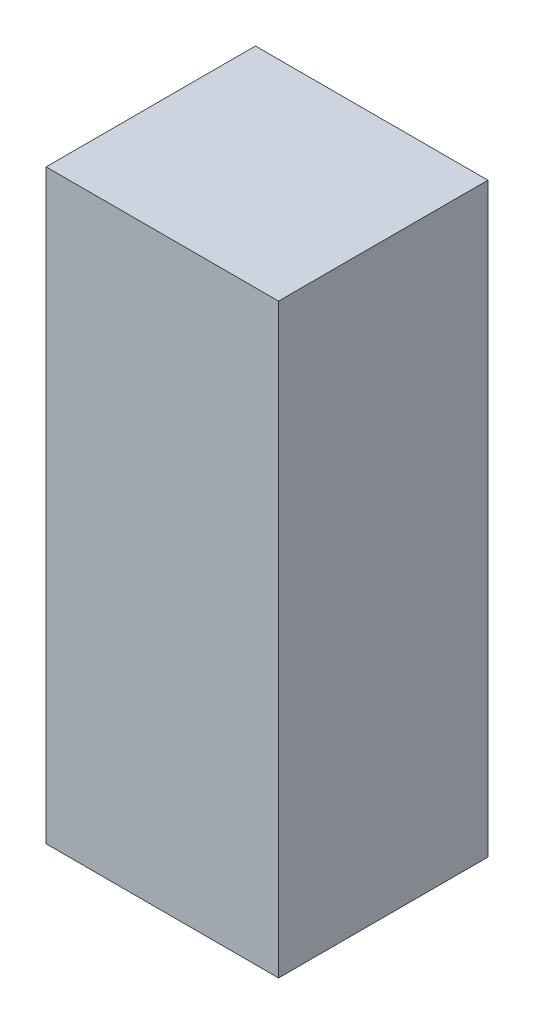
ISO-10303-21;
HEADER;
FILE_DESCRIPTION(('STEP AP214'),'2;1');
FILE_NAME('part.step','',(''),(''),'','','');
FILE_SCHEMA(('AUTOMOTIVE_DESIGN { 1 0 10303 214 1 1 1 1 }'));
ENDSEC;
DATA;
#1=APPLICATION_CONTEXT('core data for automotive mechanical design processes');
#2=APPLICATION_PROTOCOL_DEFINITION('international standard','automotive_design',2000,#1);
#3=PRODUCT_CONTEXT('',#1,'mechanical');
#4=PRODUCT('Part','Part','',(#3));
#5=PRODUCT_RELATED_PRODUCT_CATEGORY('part','',(#4));
#6=PRODUCT_DEFINITION_FORMATION('','',#4);
#7=PRODUCT_DEFINITION_CONTEXT('part definition',#1,'design');
#8=PRODUCT_DEFINITION('design','',#6,#7);
#9=PRODUCT_DEFINITION_SHAPE('','',#8);
#10=(LENGTH_UNIT() NAMED_UNIT(*) SI_UNIT(.MILLI.,.METRE.));
#11=(NAMED_UNIT(*) PLANE_ANGLE_UNIT() SI_UNIT($,.RADIAN.));
#12=(NAMED_UNIT(*) SI_UNIT($,.STERADIAN.) SOLID_ANGLE_UNIT());
#13=UNCERTAINTY_MEASURE_WITH_UNIT(LENGTH_MEASURE(1.E-05),#10,'distance_accuracy_value','');
#14=(GEOMETRIC_REPRESENTATION_CONTEXT(3) GLOBAL_UNCERTAINTY_ASSIGNED_CONTEXT((#13)) GLOBAL_UNIT_ASSIGNED_CONTEXT((#10,
#11,#12)) REPRESENTATION_CONTEXT('',''));
#15=CARTESIAN_POINT('',(0.,0.,0.));
#16=DIRECTION('',(0.,0.,1.));
#17=DIRECTION('',(1.,0.,0.));
#18=AXIS2_PLACEMENT_3D('',#15,#16,#17);
#19=CARTESIAN_POINT('',(-0.265118087285984,-10.0099997764826,1.5));
#20=DIRECTION('',(0.,0.,1.));
#21=DIRECTION('',(1.,0.,0.));
#22=AXIS2_PLACEMENT_3D('',#19,#20,#21);
#23=PLANE('',#22);
#24=DIRECTION('',(1.,0.,0.));
#25=VECTOR('',#24,1.);
#26=CARTESIAN_POINT('',(0.0224409530042465,-8.59999980777502,1.5));
#27=LINE('',#26,#25);
#28=CARTESIAN_POINT('',(-0.255118087285984,-8.59999980777502,1.5));
#29=VERTEX_POINT('',#28);
#30=CARTESIAN_POINT('',(0.299999993294477,-8.59999980777502,1.5));
#31=VERTEX_POINT('',#30);
#32=EDGE_CURVE('E70',#29,#31,#27,.T.);
#33=ORIENTED_EDGE('',*,*,#32,.F.);
#34=DIRECTION('',(0.,1.,0.));
#35=VECTOR('',#34,1.);
#36=CARTESIAN_POINT('',(-0.255118087285984,-9.29999979212881,1.5));
#37=LINE('',#36,#35);
#38=CARTESIAN_POINT('',(-0.255118087285984,-9.99999977648258,1.5));
#39=VERTEX_POINT('',#38);
#40=EDGE_CURVE('E56',#39,#29,#37,.T.);
#41=ORIENTED_EDGE('',*,*,#40,.F.);
#42=DIRECTION('',(-1.,0.,0.));
#43=VECTOR('',#42,1.);
#44=CARTESIAN_POINT('',(0.0224409530042464,-9.99999977648258,1.5));
#45=LINE('',#44,#43);
#46=CARTESIAN_POINT('',(0.299999993294477,-9.99999977648258,1.5));
#47=VERTEX_POINT('',#46);
#48=EDGE_CURVE('E20',#47,#39,#45,.T.);
#49=ORIENTED_EDGE('',*,*,#48,.F.);
#50=DIRECTION('',(0.,-1.,0.));
#51=VECTOR('',#50,1.);
#52=CARTESIAN_POINT('',(0.299999993294477,-9.29999979212881,1.5));
#53=LINE('',#52,#51);
#54=EDGE_CURVE('E88',#31,#47,#53,.T.);
#55=ORIENTED_EDGE('',*,*,#54,.F.);
#56=EDGE_LOOP('',(#33,#41,#49,#55));
#57=FACE_BOUND('',#56,.T.);
#58=ADVANCED_FACE('F16',(#57),#23,.T.);
#59=CARTESIAN_POINT('',(-0.265118087285984,-9.99999977648258,1.51));
#60=DIRECTION('',(0.,-1.,0.));
#61=DIRECTION('',(0.,0.,-1.));
#62=AXIS2_PLACEMENT_3D('',#59,#60,#61);
#63=PLANE('',#62);
#64=ORIENTED_EDGE('',*,*,#48,.T.);
#65=DIRECTION('',(0.,0.,1.));
#66=VECTOR('',#65,1.);
#67=CARTESIAN_POINT('',(-0.255118087285984,-9.99999977648258,1.25));
#68=LINE('',#67,#66);
#69=CARTESIAN_POINT('',(-0.255118087285984,-9.99999977648258,1.));
#70=VERTEX_POINT('',#69);
#71=EDGE_CURVE('E62',#70,#39,#68,.T.);
#72=ORIENTED_EDGE('',*,*,#71,.F.);
#73=DIRECTION('',(-1.,0.,0.));
#74=VECTOR('',#73,1.);
#75=CARTESIAN_POINT('',(0.0224409530042465,-9.99999977648258,1.));
#76=LINE('',#75,#74);
#77=CARTESIAN_POINT('',(0.299999993294477,-9.99999977648258,1.));
#78=VERTEX_POINT('',#77);
#79=EDGE_CURVE('E93',#78,#70,#76,.T.);
#80=ORIENTED_EDGE('',*,*,#79,.F.);
#81=DIRECTION('',(0.,0.,-1.));
#82=VECTOR('',#81,1.);
#83=CARTESIAN_POINT('',(0.299999993294477,-9.99999977648258,1.25));
#84=LINE('',#83,#82);
#85=EDGE_CURVE('E65',#47,#78,#84,.T.);
#86=ORIENTED_EDGE('',*,*,#85,.F.);
#87=EDGE_LOOP('',(#64,#72,#80,#86));
#88=FACE_BOUND('',#87,.T.);
#89=ADVANCED_FACE('F61',(#88),#63,.T.);
#90=CARTESIAN_POINT('',(-0.255118087285984,-8.58999980777502,0.99));
#91=DIRECTION('',(-1.,0.,0.));
#92=DIRECTION('',(0.,-1.,0.));
#93=AXIS2_PLACEMENT_3D('',#90,#91,#92);
#94=PLANE('',#93);
#95=ORIENTED_EDGE('',*,*,#40,.T.);
#96=DIRECTION('',(0.,0.,1.));
#97=VECTOR('',#96,1.);
#98=CARTESIAN_POINT('',(-0.255118087285984,-8.59999980777502,1.25));
#99=LINE('',#98,#97);
#100=CARTESIAN_POINT('',(-0.255118087285984,-8.59999980777502,1.));
#101=VERTEX_POINT('',#100);
#102=EDGE_CURVE('E73',#101,#29,#99,.T.);
#103=ORIENTED_EDGE('',*,*,#102,.F.);
#104=DIRECTION('',(0.,1.,0.));
#105=VECTOR('',#104,1.);
#106=CARTESIAN_POINT('',(-0.255118087285984,-9.29999979212881,1.));
#107=LINE('',#106,#105);
#108=EDGE_CURVE('E77',#70,#101,#107,.T.);
#109=ORIENTED_EDGE('',*,*,#108,.F.);
#110=ORIENTED_EDGE('',*,*,#71,.T.);
#111=EDGE_LOOP('',(#95,#103,#109,#110));
#112=FACE_BOUND('',#111,.T.);
#113=ADVANCED_FACE('F75',(#112),#94,.T.);
#114=CARTESIAN_POINT('',(0.309999993294477,-8.59999980777502,0.99));
#115=DIRECTION('',(0.,1.,0.));
#116=DIRECTION('',(-1.,0.,0.));
#117=AXIS2_PLACEMENT_3D('',#114,#115,#116);
#118=PLANE('',#117);
#119=ORIENTED_EDGE('',*,*,#32,.T.);
#120=DIRECTION('',(0.,0.,1.));
#121=VECTOR('',#120,1.);
#122=CARTESIAN_POINT('',(0.299999993294477,-8.59999980777502,1.25));
#123=LINE('',#122,#121);
#124=CARTESIAN_POINT('',(0.299999993294477,-8.59999980777502,1.));
#125=VERTEX_POINT('',#124);
#126=EDGE_CURVE('E36',#125,#31,#123,.T.);
#127=ORIENTED_EDGE('',*,*,#126,.F.);
#128=DIRECTION('',(1.,0.,0.));
#129=VECTOR('',#128,1.);
#130=CARTESIAN_POINT('',(0.0224409530042465,-8.59999980777502,1.));
#131=LINE('',#130,#129);
#132=EDGE_CURVE('E27',#101,#125,#131,.T.);
#133=ORIENTED_EDGE('',*,*,#132,.F.);
#134=ORIENTED_EDGE('',*,*,#102,.T.);
#135=EDGE_LOOP('',(#119,#127,#133,#134));
#136=FACE_BOUND('',#135,.T.);
#137=ADVANCED_FACE('F101',(#136),#118,.T.);
#138=CARTESIAN_POINT('',(0.299999993294477,-10.0099997764826,0.99));
#139=DIRECTION('',(1.,0.,0.));
#140=DIRECTION('',(0.,1.,0.));
#141=AXIS2_PLACEMENT_3D('',#138,#139,#140);
#142=PLANE('',#141);
#143=ORIENTED_EDGE('',*,*,#54,.T.);
#144=ORIENTED_EDGE('',*,*,#85,.T.);
#145=DIRECTION('',(0.,-1.,0.));
#146=VECTOR('',#145,1.);
#147=CARTESIAN_POINT('',(0.299999993294477,-9.29999979212881,1.));
#148=LINE('',#147,#146);
#149=EDGE_CURVE('E11',#125,#78,#148,.T.);
#150=ORIENTED_EDGE('',*,*,#149,.F.);
#151=ORIENTED_EDGE('',*,*,#126,.T.);
#152=EDGE_LOOP('',(#143,#144,#150,#151));
#153=FACE_BOUND('',#152,.T.);
#154=ADVANCED_FACE('F103',(#153),#142,.T.);
#155=CARTESIAN_POINT('',(0.309999993294477,-10.0099997764826,1.));
#156=DIRECTION('',(0.,0.,-1.));
#157=DIRECTION('',(-1.,0.,0.));
#158=AXIS2_PLACEMENT_3D('',#155,#156,#157);
#159=PLANE('',#158);
#160=ORIENTED_EDGE('',*,*,#132,.T.);
#161=ORIENTED_EDGE('',*,*,#149,.T.);
#162=ORIENTED_EDGE('',*,*,#79,.T.);
#163=ORIENTED_EDGE('',*,*,#108,.T.);
#164=EDGE_LOOP('',(#160,#161,#162,#163));
#165=FACE_BOUND('',#164,.T.);
#166=ADVANCED_FACE('F18',(#165),#159,.T.);
#167=CLOSED_SHELL('',(#58,#89,#113,#137,#154,#166));
#168=MANIFOLD_SOLID_BREP('B1',#167);
#169=ADVANCED_BREP_SHAPE_REPRESENTATION('',(#18,#168),#14);
#170=SHAPE_DEFINITION_REPRESENTATION(#9,#169);
ENDSEC;
END-ISO-10303-21;
